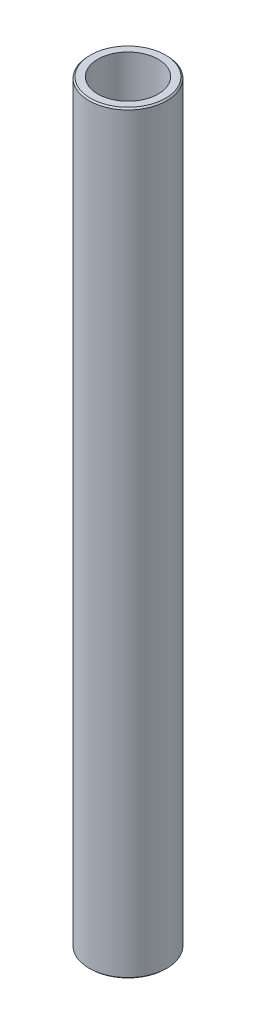
ISO-10303-21;
HEADER;
FILE_DESCRIPTION(('STEP AP214'),'2;1');
FILE_NAME('part.step','',(''),(''),'','','');
FILE_SCHEMA(('AUTOMOTIVE_DESIGN { 1 0 10303 214 1 1 1 1 }'));
ENDSEC;
DATA;
#1=APPLICATION_CONTEXT('core data for automotive mechanical design processes');
#2=APPLICATION_PROTOCOL_DEFINITION('international standard','automotive_design',2000,#1);
#3=PRODUCT_CONTEXT('',#1,'mechanical');
#4=PRODUCT('Part','Part','',(#3));
#5=PRODUCT_RELATED_PRODUCT_CATEGORY('part','',(#4));
#6=PRODUCT_DEFINITION_FORMATION('','',#4);
#7=PRODUCT_DEFINITION_CONTEXT('part definition',#1,'design');
#8=PRODUCT_DEFINITION('design','',#6,#7);
#9=PRODUCT_DEFINITION_SHAPE('','',#8);
#10=(LENGTH_UNIT() NAMED_UNIT(*) SI_UNIT(.MILLI.,.METRE.));
#11=(NAMED_UNIT(*) PLANE_ANGLE_UNIT() SI_UNIT($,.RADIAN.));
#12=(NAMED_UNIT(*) SI_UNIT($,.STERADIAN.) SOLID_ANGLE_UNIT());
#13=UNCERTAINTY_MEASURE_WITH_UNIT(LENGTH_MEASURE(1.E-05),#10,'distance_accuracy_value','');
#14=(GEOMETRIC_REPRESENTATION_CONTEXT(3) GLOBAL_UNCERTAINTY_ASSIGNED_CONTEXT((#13)) GLOBAL_UNIT_ASSIGNED_CONTEXT((#10,
#11,#12)) REPRESENTATION_CONTEXT('',''));
#15=CARTESIAN_POINT('',(0.,0.,0.));
#16=DIRECTION('',(0.,0.,1.));
#17=DIRECTION('',(1.,0.,0.));
#18=AXIS2_PLACEMENT_3D('',#15,#16,#17);
#19=CARTESIAN_POINT('',(0.,387.864817956627,0.));
#20=DIRECTION('',(0.,-1.,0.));
#21=DIRECTION('',(0.,0.,-1.));
#22=AXIS2_PLACEMENT_3D('',#19,#20,#21);
#23=CYLINDRICAL_SURFACE('',#22,20.);
#24=CARTESIAN_POINT('',(0.,387.125163439188,0.));
#25=DIRECTION('',(0.,1.,0.));
#26=DIRECTION('',(0.,0.,1.));
#27=AXIS2_PLACEMENT_3D('',#24,#25,#26);
#28=CIRCLE('',#27,20.);
#29=CARTESIAN_POINT('',(0.,387.125163439188,20.));
#30=VERTEX_POINT('',#29);
#31=EDGE_CURVE('E50',#30,#30,#28,.F.);
#32=ORIENTED_EDGE('',*,*,#31,.T.);
#33=EDGE_LOOP('',(#32));
#34=FACE_BOUND('',#33,.T.);
#35=CARTESIAN_POINT('',(0.,0.712931181183929,0.));
#36=DIRECTION('',(0.,1.,0.));
#37=DIRECTION('',(0.,0.,1.));
#38=AXIS2_PLACEMENT_3D('',#35,#36,#37);
#39=CIRCLE('',#38,20.);
#40=CARTESIAN_POINT('',(0.,0.712931181183929,20.));
#41=VERTEX_POINT('',#40);
#42=EDGE_CURVE('E51',#41,#41,#39,.T.);
#43=ORIENTED_EDGE('',*,*,#42,.T.);
#44=EDGE_LOOP('',(#43));
#45=FACE_BOUND('',#44,.T.);
#46=ADVANCED_FACE('F39',(#34,#45),#23,.T.);
#47=CARTESIAN_POINT('',(0.,387.864817956627,0.));
#48=DIRECTION('',(0.,1.,0.));
#49=DIRECTION('',(0.,0.,1.));
#50=AXIS2_PLACEMENT_3D('',#47,#48,#49);
#51=PLANE('',#50);
#52=CARTESIAN_POINT('',(0.,387.864817956627,0.));
#53=DIRECTION('',(0.,1.,0.));
#54=DIRECTION('',(0.,0.,1.));
#55=AXIS2_PLACEMENT_3D('',#52,#53,#54);
#56=CIRCLE('',#55,19.2870688188163);
#57=CARTESIAN_POINT('',(0.,387.864817956627,19.2870688188163));
#58=VERTEX_POINT('',#57);
#59=EDGE_CURVE('E54',#58,#58,#56,.T.);
#60=ORIENTED_EDGE('',*,*,#59,.T.);
#61=EDGE_LOOP('',(#60));
#62=FACE_BOUND('',#61,.T.);
#63=CARTESIAN_POINT('',(0.,387.864817956627,0.));
#64=DIRECTION('',(0.,1.,0.));
#65=DIRECTION('',(0.,0.,1.));
#66=AXIS2_PLACEMENT_3D('',#63,#64,#65);
#67=CIRCLE('',#66,15.5213254425843);
#68=CARTESIAN_POINT('',(0.,387.864817956627,15.5213254425843));
#69=VERTEX_POINT('',#68);
#70=EDGE_CURVE('E58',#69,#69,#67,.T.);
#71=ORIENTED_EDGE('',*,*,#70,.F.);
#72=EDGE_LOOP('',(#71));
#73=FACE_BOUND('',#72,.T.);
#74=ADVANCED_FACE('F69',(#62,#73),#51,.T.);
#75=CARTESIAN_POINT('',(0.,0.,0.));
#76=DIRECTION('',(0.,1.,0.));
#77=DIRECTION('',(0.,0.,1.));
#78=AXIS2_PLACEMENT_3D('',#75,#76,#77);
#79=PLANE('',#78);
#80=CARTESIAN_POINT('',(0.,0.,0.));
#81=DIRECTION('',(0.,1.,0.));
#82=DIRECTION('',(0.,0.,1.));
#83=AXIS2_PLACEMENT_3D('',#80,#81,#82);
#84=CIRCLE('',#83,19.2603454825606);
#85=CARTESIAN_POINT('',(0.,0.,19.2603454825606));
#86=VERTEX_POINT('',#85);
#87=EDGE_CURVE('E10',#86,#86,#84,.F.);
#88=ORIENTED_EDGE('',*,*,#87,.T.);
#89=EDGE_LOOP('',(#88));
#90=FACE_BOUND('',#89,.T.);
#91=CARTESIAN_POINT('',(0.,0.,0.));
#92=DIRECTION('',(0.,1.,0.));
#93=DIRECTION('',(0.,0.,1.));
#94=AXIS2_PLACEMENT_3D('',#91,#92,#93);
#95=CIRCLE('',#94,15.5213254425843);
#96=CARTESIAN_POINT('',(0.,0.,15.5213254425843));
#97=VERTEX_POINT('',#96);
#98=EDGE_CURVE('E63',#97,#97,#95,.T.);
#99=ORIENTED_EDGE('',*,*,#98,.T.);
#100=EDGE_LOOP('',(#99));
#101=FACE_BOUND('',#100,.T.);
#102=ADVANCED_FACE('F75',(#90,#101),#79,.F.);
#103=CARTESIAN_POINT('',(0.,387.864817956627,0.));
#104=DIRECTION('',(0.,-1.,0.));
#105=DIRECTION('',(0.,0.,-1.));
#106=AXIS2_PLACEMENT_3D('',#103,#104,#105);
#107=CYLINDRICAL_SURFACE('',#106,15.5213254425843);
#108=ORIENTED_EDGE('',*,*,#70,.T.);
#109=EDGE_LOOP('',(#108));
#110=FACE_BOUND('',#109,.T.);
#111=ORIENTED_EDGE('',*,*,#98,.F.);
#112=EDGE_LOOP('',(#111));
#113=FACE_BOUND('',#112,.T.);
#114=ADVANCED_FACE('F70',(#110,#113),#107,.F.);
#115=CARTESIAN_POINT('',(0.,387.864817956627,0.));
#116=DIRECTION('',(0.,-1.,0.));
#117=DIRECTION('',(0.,0.,-1.));
#118=AXIS2_PLACEMENT_3D('',#115,#116,#117);
#119=CONICAL_SURFACE('',#118,19.2870688188163,0.767003157834371);
#120=ORIENTED_EDGE('',*,*,#31,.F.);
#121=EDGE_LOOP('',(#120));
#122=FACE_BOUND('',#121,.T.);
#123=ORIENTED_EDGE('',*,*,#59,.F.);
#124=EDGE_LOOP('',(#123));
#125=FACE_BOUND('',#124,.T.);
#126=ADVANCED_FACE('F81',(#122,#125),#119,.T.);
#127=CARTESIAN_POINT('',(0.,0.712931181183929,0.));
#128=DIRECTION('',(0.,1.,0.));
#129=DIRECTION('',(0.,0.,1.));
#130=AXIS2_PLACEMENT_3D('',#127,#128,#129);
#131=CONICAL_SURFACE('',#130,20.,0.803793168960459);
#132=CARTESIAN_POINT('',(0.,0.,19.2603454825606));
#133=CARTESIAN_POINT('',(0.,0.00742636647066663,19.2680502171172));
#134=CARTESIAN_POINT('',(0.,0.0148527329413323,19.2757549516739));
#135=CARTESIAN_POINT('',(0.,0.0297054658826636,19.2911644207872));
#136=CARTESIAN_POINT('',(0.,0.0371318323533293,19.2988691553439));
#137=CARTESIAN_POINT('',(0.,0.051984565294661,19.3142786244572));
#138=CARTESIAN_POINT('',(0.,0.0594109317653271,19.3219833590138));
#139=CARTESIAN_POINT('',(0.,0.0742636647066593,19.3373928281272));
#140=CARTESIAN_POINT('',(0.,0.0816900311773255,19.3450975626838));
#141=CARTESIAN_POINT('',(0.,0.0965427641186571,19.3605070317972));
#142=CARTESIAN_POINT('',(0.,0.103969130589323,19.3682117663538));
#143=CARTESIAN_POINT('',(0.,0.118821863530654,19.3836212354671));
#144=CARTESIAN_POINT('',(0.,0.12624823000132,19.3913259700238));
#145=CARTESIAN_POINT('',(0.,0.141100962942653,19.4067354391371));
#146=CARTESIAN_POINT('',(0.,0.148527329413319,19.4144401736938));
#147=CARTESIAN_POINT('',(0.,0.16338006235465,19.4298496428071));
#148=CARTESIAN_POINT('',(0.,0.170806428825316,19.4375543773638));
#149=CARTESIAN_POINT('',(0.,0.185659161766648,19.4529638464771));
#150=CARTESIAN_POINT('',(0.,0.193085528237314,19.4606685810337));
#151=CARTESIAN_POINT('',(0.,0.207938261178646,19.4760780501471));
#152=CARTESIAN_POINT('',(0.,0.215364627649312,19.4837827847037));
#153=CARTESIAN_POINT('',(0.,0.230217360590644,19.499192253817));
#154=CARTESIAN_POINT('',(0.,0.237643727061309,19.5068969883737));
#155=CARTESIAN_POINT('',(0.,0.252496460002641,19.522306457487));
#156=CARTESIAN_POINT('',(0.,0.259922826473307,19.5300111920437));
#157=CARTESIAN_POINT('',(0.,0.274775559414639,19.545420661157));
#158=CARTESIAN_POINT('',(0.,0.282201925885306,19.5531253957137));
#159=CARTESIAN_POINT('',(0.,0.297054658826637,19.568534864827));
#160=CARTESIAN_POINT('',(0.,0.304481025297303,19.5762395993837));
#161=CARTESIAN_POINT('',(0.,0.319333758238634,19.591649068497));
#162=CARTESIAN_POINT('',(0.,0.3267601247093,19.5993538030536));
#163=CARTESIAN_POINT('',(0.,0.341612857650633,19.614763272167));
#164=CARTESIAN_POINT('',(0.,0.349039224121299,19.6224680067236));
#165=CARTESIAN_POINT('',(0.,0.363891957062631,19.6378774758369));
#166=CARTESIAN_POINT('',(0.,0.371318323533296,19.6455822103936));
#167=CARTESIAN_POINT('',(0.,0.386171056474628,19.6609916795069));
#168=CARTESIAN_POINT('',(0.,0.393597422945294,19.6686964140636));
#169=CARTESIAN_POINT('',(0.,0.408450155886626,19.6841058831769));
#170=CARTESIAN_POINT('',(0.,0.415876522357292,19.6918106177336));
#171=CARTESIAN_POINT('',(0.,0.430729255298624,19.7072200868469));
#172=CARTESIAN_POINT('',(0.,0.438155621769289,19.7149248214035));
#173=CARTESIAN_POINT('',(0.,0.453008354710621,19.7303342905169));
#174=CARTESIAN_POINT('',(0.,0.460434721181288,19.7380390250735));
#175=CARTESIAN_POINT('',(0.,0.47528745412262,19.7534484941869));
#176=CARTESIAN_POINT('',(0.,0.482713820593285,19.7611532287435));
#177=CARTESIAN_POINT('',(0.,0.497566553534617,19.7765626978568));
#178=CARTESIAN_POINT('',(0.,0.504992920005283,19.7842674324135));
#179=CARTESIAN_POINT('',(0.,0.519845652946615,19.7996769015268));
#180=CARTESIAN_POINT('',(0.,0.527272019417281,19.8073816360835));
#181=CARTESIAN_POINT('',(0.,0.542124752358613,19.8227911051968));
#182=CARTESIAN_POINT('',(0.,0.549551118829278,19.8304958397535));
#183=CARTESIAN_POINT('',(0.,0.56440385177061,19.8459053088668));
#184=CARTESIAN_POINT('',(0.,0.571830218241276,19.8536100434234));
#185=CARTESIAN_POINT('',(0.,0.586682951182608,19.8690195125368));
#186=CARTESIAN_POINT('',(0.,0.594109317653275,19.8767242470934));
#187=CARTESIAN_POINT('',(0.,0.608962050594606,19.8921337162068));
#188=CARTESIAN_POINT('',(0.,0.616388417065272,19.8998384507634));
#189=CARTESIAN_POINT('',(0.,0.631241150006603,19.9152479198767));
#190=CARTESIAN_POINT('',(0.,0.638667516477269,19.9229526544334));
#191=CARTESIAN_POINT('',(0.,0.653520249418602,19.9383621235467));
#192=CARTESIAN_POINT('',(0.,0.660946615889268,19.9460668581034));
#193=CARTESIAN_POINT('',(0.,0.6757993488306,19.9614763272167));
#194=CARTESIAN_POINT('',(0.,0.683225715301265,19.9691810617734));
#195=CARTESIAN_POINT('',(0.,0.698078448242597,19.9845905308867));
#196=CARTESIAN_POINT('',(0.,0.705504814713262,19.9922952654433));
#197=CARTESIAN_POINT('',(0.,0.712931181183929,20.));
#198=B_SPLINE_CURVE_WITH_KNOTS('',3,(#132,#133,#134,#135,#136,#137,#138,#139,#140,#141,#142,
#143,#144,#145,#146,#147,#148,#149,#150,#151,#152,#153,#154,#155,#156,#157,#158,#159,#160,#161,
#162,#163,#164,#165,#166,#167,#168,#169,#170,#171,#172,#173,#174,#175,#176,#177,#178,#179,#180,
#181,#182,#183,#184,#185,#186,#187,#188,#189,#190,#191,#192,#193,#194,#195,#196,#197),
.UNSPECIFIED.,.F.,.F.,(4,2,2,2,2,2,2,2,2,2,2,2,2,2,2,2,2,2,2,2,2,2,2,2,2,2,2,2,2,2,2,2,4),(0.,
0.0321033437807818,0.064206687561566,0.0963100313423478,0.12841337512313,0.160516718903914,
0.192620062684696,0.224723406465477,0.256826750246262,0.288930094027043,0.321033437807825,
0.353136781588609,0.385240125369391,0.417343469150173,0.449446812930957,0.481550156711739,
0.513653500492521,0.545756844273305,0.577860188054087,0.609963531834868,0.642066875615653,
0.674170219396434,0.706273563177219,0.738376906958,0.770480250738782,0.802583594519566,
0.834686938300348,0.86679028208113,0.898893625861914,0.930996969642696,0.963100313423478,
0.995203657204262,1.02730700098504),.UNSPECIFIED.);
#199=EDGE_CURVE('BSEAM45',#86,#41,#198,.T.);
#200=ORIENTED_EDGE('',*,*,#87,.F.);
#201=ORIENTED_EDGE('',*,*,#42,.F.);
#202=ORIENTED_EDGE('',*,*,#199,.T.);
#203=ORIENTED_EDGE('',*,*,#199,.F.);
#204=EDGE_LOOP('',(#200,#202,#201,#203));
#205=FACE_BOUND('',#204,.T.);
#206=ADVANCED_FACE('F45',(#205),#131,.T.);
#207=CLOSED_SHELL('',(#46,#74,#102,#114,#126,#206));
#208=MANIFOLD_SOLID_BREP('B2',#207);
#209=ADVANCED_BREP_SHAPE_REPRESENTATION('',(#18,#208),#14);
#210=SHAPE_DEFINITION_REPRESENTATION(#9,#209);
ENDSEC;
END-ISO-10303-21;
